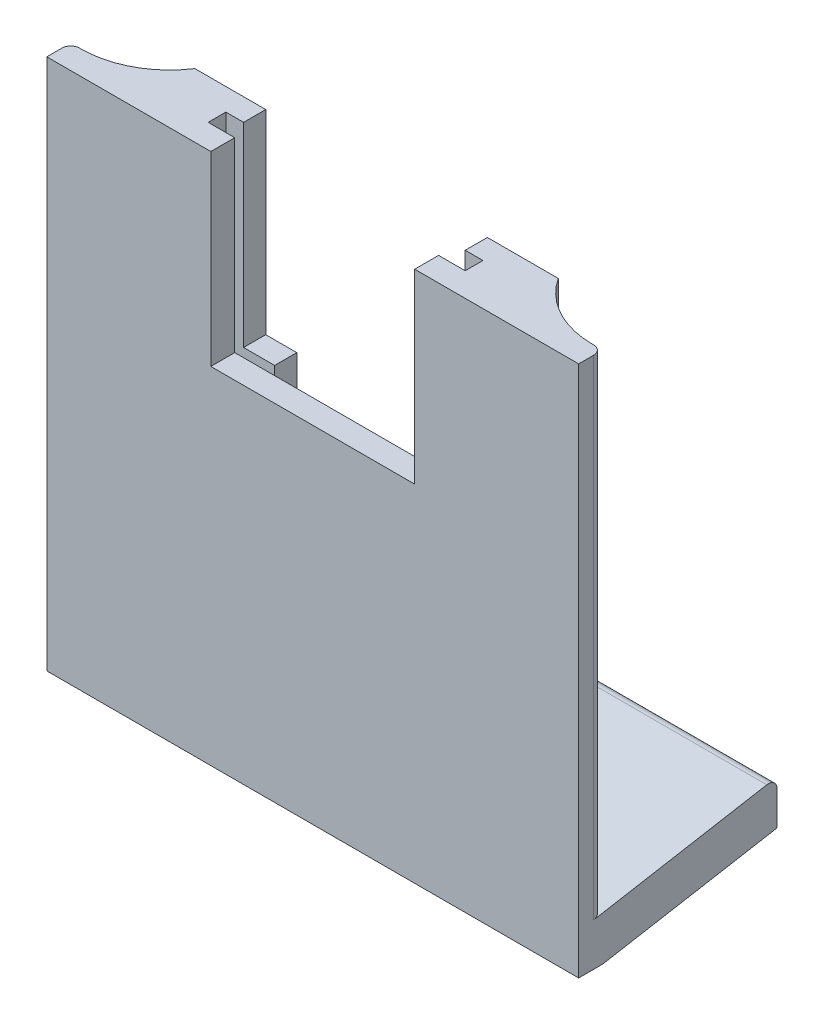
ISO-10303-21;
HEADER;
FILE_DESCRIPTION(('STEP AP214'),'2;1');
FILE_NAME('part.step','',(''),(''),'','','');
FILE_SCHEMA(('AUTOMOTIVE_DESIGN { 1 0 10303 214 1 1 1 1 }'));
ENDSEC;
DATA;
#1=APPLICATION_CONTEXT('core data for automotive mechanical design processes');
#2=APPLICATION_PROTOCOL_DEFINITION('international standard','automotive_design',2000,#1);
#3=PRODUCT_CONTEXT('',#1,'mechanical');
#4=PRODUCT('Part','Part','',(#3));
#5=PRODUCT_RELATED_PRODUCT_CATEGORY('part','',(#4));
#6=PRODUCT_DEFINITION_FORMATION('','',#4);
#7=PRODUCT_DEFINITION_CONTEXT('part definition',#1,'design');
#8=PRODUCT_DEFINITION('design','',#6,#7);
#9=PRODUCT_DEFINITION_SHAPE('','',#8);
#10=(LENGTH_UNIT() NAMED_UNIT(*) SI_UNIT(.MILLI.,.METRE.));
#11=(NAMED_UNIT(*) PLANE_ANGLE_UNIT() SI_UNIT($,.RADIAN.));
#12=(NAMED_UNIT(*) SI_UNIT($,.STERADIAN.) SOLID_ANGLE_UNIT());
#13=UNCERTAINTY_MEASURE_WITH_UNIT(LENGTH_MEASURE(1.E-05),#10,'distance_accuracy_value','');
#14=(GEOMETRIC_REPRESENTATION_CONTEXT(3) GLOBAL_UNCERTAINTY_ASSIGNED_CONTEXT((#13)) GLOBAL_UNIT_ASSIGNED_CONTEXT((#10,
#11,#12)) REPRESENTATION_CONTEXT('',''));
#15=CARTESIAN_POINT('',(0.,0.,0.));
#16=DIRECTION('',(0.,0.,1.));
#17=DIRECTION('',(1.,0.,0.));
#18=AXIS2_PLACEMENT_3D('',#15,#16,#17);
#19=CARTESIAN_POINT('',(-47.8734939759036,16.7228915662651,-2.));
#20=DIRECTION('',(0.,-1.,0.));
#21=DIRECTION('',(0.,0.,-1.));
#22=AXIS2_PLACEMENT_3D('',#19,#20,#21);
#23=PLANE('',#22);
#24=DIRECTION('',(1.,0.,0.));
#25=VECTOR('',#24,1.);
#26=CARTESIAN_POINT('',(-47.8734939759036,16.7228915662651,0.));
#27=LINE('',#26,#25);
#28=CARTESIAN_POINT('',(-47.8734939759036,16.7228915662651,0.));
#29=VERTEX_POINT('',#28);
#30=CARTESIAN_POINT('',(-42.3734939759036,16.7228915662651,0.));
#31=VERTEX_POINT('',#30);
#32=EDGE_CURVE('E367',#29,#31,#27,.T.);
#33=ORIENTED_EDGE('',*,*,#32,.T.);
#34=DIRECTION('',(0.,0.,-1.));
#35=VECTOR('',#34,1.);
#36=CARTESIAN_POINT('',(-42.3734939759036,16.7228915662651,-2.));
#37=LINE('',#36,#35);
#38=CARTESIAN_POINT('',(-42.3734939759036,16.7228915662651,-2.));
#39=VERTEX_POINT('',#38);
#40=EDGE_CURVE('E304',#31,#39,#37,.T.);
#41=ORIENTED_EDGE('',*,*,#40,.T.);
#42=DIRECTION('',(1.,0.,0.));
#43=VECTOR('',#42,1.);
#44=CARTESIAN_POINT('',(-47.8734939759036,16.7228915662651,-2.));
#45=LINE('',#44,#43);
#46=CARTESIAN_POINT('',(-47.8734939759036,16.7228915662651,-2.));
#47=VERTEX_POINT('',#46);
#48=EDGE_CURVE('E356',#47,#39,#45,.T.);
#49=ORIENTED_EDGE('',*,*,#48,.F.);
#50=DIRECTION('',(0.,0.,1.));
#51=VECTOR('',#50,1.);
#52=CARTESIAN_POINT('',(-47.8734939759036,16.7228915662651,-2.));
#53=LINE('',#52,#51);
#54=EDGE_CURVE('E366',#47,#29,#53,.T.);
#55=ORIENTED_EDGE('',*,*,#54,.T.);
#56=EDGE_LOOP('',(#33,#41,#49,#55));
#57=FACE_BOUND('',#56,.T.);
#58=ADVANCED_FACE('F39',(#57),#23,.F.);
#59=CARTESIAN_POINT('',(0.,0.,-2.));
#60=DIRECTION('',(0.,0.,-1.));
#61=DIRECTION('',(-1.,0.,0.));
#62=AXIS2_PLACEMENT_3D('',#59,#60,#61);
#63=PLANE('',#62);
#64=ORIENTED_EDGE('',*,*,#48,.T.);
#65=DIRECTION('',(0.,1.,0.));
#66=VECTOR('',#65,1.);
#67=CARTESIAN_POINT('',(-42.3734939759036,0.,-2.));
#68=LINE('',#67,#66);
#69=CARTESIAN_POINT('',(-42.3734939759036,18.7228915662651,-2.));
#70=VERTEX_POINT('',#69);
#71=EDGE_CURVE('E301',#39,#70,#68,.T.);
#72=ORIENTED_EDGE('',*,*,#71,.T.);
#73=DIRECTION('',(1.,0.,0.));
#74=VECTOR('',#73,1.);
#75=CARTESIAN_POINT('',(-45.8734939759036,18.7228915662651,-2.));
#76=LINE('',#75,#74);
#77=CARTESIAN_POINT('',(-45.8734939759036,18.7228915662651,-2.));
#78=VERTEX_POINT('',#77);
#79=EDGE_CURVE('E340',#78,#70,#76,.T.);
#80=ORIENTED_EDGE('',*,*,#79,.F.);
#81=DIRECTION('',(0.,-1.,0.));
#82=VECTOR('',#81,1.);
#83=CARTESIAN_POINT('',(-45.8734939759036,40.7228915662651,-2.));
#84=LINE('',#83,#82);
#85=CARTESIAN_POINT('',(-45.8734939759036,40.7228915662651,-2.));
#86=VERTEX_POINT('',#85);
#87=EDGE_CURVE('E337',#86,#78,#84,.T.);
#88=ORIENTED_EDGE('',*,*,#87,.F.);
#89=DIRECTION('',(1.,0.,0.));
#90=VECTOR('',#89,1.);
#91=CARTESIAN_POINT('',(-45.8734939759036,40.7228915662651,-2.));
#92=LINE('',#91,#90);
#93=CARTESIAN_POINT('',(-47.8734939759036,40.7228915662651,-2.));
#94=VERTEX_POINT('',#93);
#95=EDGE_CURVE('E335',#94,#86,#92,.T.);
#96=ORIENTED_EDGE('',*,*,#95,.F.);
#97=DIRECTION('',(0.,-1.,0.));
#98=VECTOR('',#97,1.);
#99=CARTESIAN_POINT('',(-47.8734939759036,16.7228915662651,-2.));
#100=LINE('',#99,#98);
#101=EDGE_CURVE('E363',#94,#47,#100,.T.);
#102=ORIENTED_EDGE('',*,*,#101,.T.);
#103=EDGE_LOOP('',(#64,#72,#80,#88,#96,#102));
#104=FACE_BOUND('',#103,.T.);
#105=ADVANCED_FACE('F517',(#104),#63,.F.);
#106=CARTESIAN_POINT('',(-45.8734939759036,18.7228915662651,-4.5));
#107=DIRECTION('',(0.,-1.,0.));
#108=DIRECTION('',(0.,0.,-1.));
#109=AXIS2_PLACEMENT_3D('',#106,#107,#108);
#110=PLANE('',#109);
#111=ORIENTED_EDGE('',*,*,#79,.T.);
#112=DIRECTION('',(0.,0.,-1.));
#113=VECTOR('',#112,1.);
#114=CARTESIAN_POINT('',(-42.3734939759036,18.7228915662651,26.926842746113));
#115=LINE('',#114,#113);
#116=CARTESIAN_POINT('',(-42.3734939759036,18.7228915662651,-4.5));
#117=VERTEX_POINT('',#116);
#118=EDGE_CURVE('E292',#70,#117,#115,.T.);
#119=ORIENTED_EDGE('',*,*,#118,.T.);
#120=DIRECTION('',(1.,0.,0.));
#121=VECTOR('',#120,1.);
#122=CARTESIAN_POINT('',(-45.8734939759036,18.7228915662651,-4.5));
#123=LINE('',#122,#121);
#124=CARTESIAN_POINT('',(-45.8734939759036,18.7228915662651,-4.5));
#125=VERTEX_POINT('',#124);
#126=EDGE_CURVE('E327',#125,#117,#123,.T.);
#127=ORIENTED_EDGE('',*,*,#126,.F.);
#128=DIRECTION('',(0.,0.,1.));
#129=VECTOR('',#128,1.);
#130=CARTESIAN_POINT('',(-45.8734939759036,18.7228915662651,-4.5));
#131=LINE('',#130,#129);
#132=EDGE_CURVE('E349',#125,#78,#131,.T.);
#133=ORIENTED_EDGE('',*,*,#132,.T.);
#134=EDGE_LOOP('',(#111,#119,#127,#133));
#135=FACE_BOUND('',#134,.T.);
#136=ADVANCED_FACE('F525',(#135),#110,.F.);
#137=CARTESIAN_POINT('',(0.,0.,-4.5));
#138=DIRECTION('',(0.,0.,-1.));
#139=DIRECTION('',(-1.,0.,0.));
#140=AXIS2_PLACEMENT_3D('',#137,#138,#139);
#141=PLANE('',#140);
#142=DIRECTION('',(0.,1.,0.));
#143=VECTOR('',#142,1.);
#144=CARTESIAN_POINT('',(-42.3734939759036,-1.30346257706057,-4.5));
#145=LINE('',#144,#143);
#146=CARTESIAN_POINT('',(-42.3734939759036,10.7228915662651,-4.5));
#147=VERTEX_POINT('',#146);
#148=EDGE_CURVE('E281',#147,#117,#145,.T.);
#149=ORIENTED_EDGE('',*,*,#148,.F.);
#150=DIRECTION('',(-1.,0.,0.));
#151=VECTOR('',#150,1.);
#152=CARTESIAN_POINT('',(-12.8734939759036,10.7228915662651,-4.5));
#153=LINE('',#152,#151);
#154=CARTESIAN_POINT('',(-53.8734939759036,10.7228915662651,-4.5));
#155=VERTEX_POINT('',#154);
#156=EDGE_CURVE('E315',#147,#155,#153,.T.);
#157=ORIENTED_EDGE('',*,*,#156,.T.);
#158=DIRECTION('',(0.,1.,0.));
#159=VECTOR('',#158,1.);
#160=CARTESIAN_POINT('',(-53.8734939759036,10.7228915662651,-4.5));
#161=LINE('',#160,#159);
#162=CARTESIAN_POINT('',(-53.8734939759036,40.7228915662651,-4.5));
#163=VERTEX_POINT('',#162);
#164=EDGE_CURVE('E319',#155,#163,#161,.T.);
#165=ORIENTED_EDGE('',*,*,#164,.T.);
#166=DIRECTION('',(1.,0.,0.));
#167=VECTOR('',#166,1.);
#168=CARTESIAN_POINT('',(-45.8734939759036,40.7228915662651,-4.5));
#169=LINE('',#168,#167);
#170=CARTESIAN_POINT('',(-45.8734939759036,40.7228915662651,-4.5));
#171=VERTEX_POINT('',#170);
#172=EDGE_CURVE('E322',#163,#171,#169,.T.);
#173=ORIENTED_EDGE('',*,*,#172,.T.);
#174=DIRECTION('',(0.,-1.,0.));
#175=VECTOR('',#174,1.);
#176=CARTESIAN_POINT('',(-45.8734939759036,40.7228915662651,-4.5));
#177=LINE('',#176,#175);
#178=EDGE_CURVE('E324',#171,#125,#177,.T.);
#179=ORIENTED_EDGE('',*,*,#178,.T.);
#180=ORIENTED_EDGE('',*,*,#126,.T.);
#181=EDGE_LOOP('',(#149,#157,#165,#173,#179,#180));
#182=FACE_BOUND('',#181,.T.);
#183=ADVANCED_FACE('F598',(#182),#141,.T.);
#184=CARTESIAN_POINT('',(-53.8734939759036,2.37124502202004,-10.));
#185=DIRECTION('',(-1.,0.,0.));
#186=DIRECTION('',(0.,-1.,0.));
#187=AXIS2_PLACEMENT_3D('',#184,#185,#186);
#188=CYLINDRICAL_SURFACE('',#187,10.);
#189=ORIENTED_EDGE('',*,*,#156,.F.);
#190=CARTESIAN_POINT('',(-42.3734939759036,2.37124502202003,-10.));
#191=DIRECTION('',(-1.,0.,0.));
#192=DIRECTION('',(0.,0.,1.));
#193=AXIS2_PLACEMENT_3D('',#190,#191,#192);
#194=CIRCLE('',#193,10.);
#195=CARTESIAN_POINT('',(-42.3734939759036,2.37124502202003,0.));
#196=VERTEX_POINT('',#195);
#197=EDGE_CURVE('E462',#147,#196,#194,.F.);
#198=ORIENTED_EDGE('',*,*,#197,.T.);
#199=DIRECTION('',(-1.,0.,0.));
#200=VECTOR('',#199,1.);
#201=CARTESIAN_POINT('',(0.,2.37124502202003,0.));
#202=LINE('',#201,#200);
#203=CARTESIAN_POINT('',(-62.2251405201487,2.37124502202004,0.));
#204=VERTEX_POINT('',#203);
#205=EDGE_CURVE('E451',#204,#196,#202,.F.);
#206=ORIENTED_EDGE('',*,*,#205,.F.);
#207=CARTESIAN_POINT('',(-62.2251405201487,2.37124502202004,-10.));
#208=DIRECTION('',(-0.707106781186547,0.707106781186548,0.));
#209=DIRECTION('',(0.707106781186548,0.707106781186547,0.));
#210=AXIS2_PLACEMENT_3D('',#207,#208,#209);
#211=ELLIPSE('',#210,14.1421356237309,10.);
#212=EDGE_CURVE('E454',#155,#204,#211,.F.);
#213=ORIENTED_EDGE('',*,*,#212,.F.);
#214=EDGE_LOOP('',(#189,#198,#206,#213));
#215=FACE_BOUND('',#214,.T.);
#216=ADVANCED_FACE('F640',(#215),#188,.F.);
#217=CARTESIAN_POINT('',(0.,0.,0.));
#218=DIRECTION('',(0.,0.,1.));
#219=DIRECTION('',(1.,0.,0.));
#220=AXIS2_PLACEMENT_3D('',#217,#218,#219);
#221=PLANE('',#220);
#222=DIRECTION('',(1.,0.,0.));
#223=VECTOR('',#222,1.);
#224=CARTESIAN_POINT('',(0.,40.7228915662651,0.));
#225=LINE('',#224,#223);
#226=CARTESIAN_POINT('',(-4.52184743165859,40.7228915662651,0.));
#227=VERTEX_POINT('',#226);
#228=CARTESIAN_POINT('',(-4.37349397590363,40.7228915662651,0.));
#229=VERTEX_POINT('',#228);
#230=EDGE_CURVE('E417',#227,#229,#225,.T.);
#231=ORIENTED_EDGE('',*,*,#230,.T.);
#232=DIRECTION('',(0.,-1.,0.));
#233=VECTOR('',#232,1.);
#234=CARTESIAN_POINT('',(-4.37349397590362,-14.2771084337349,0.));
#235=LINE('',#234,#233);
#236=CARTESIAN_POINT('',(-4.37349397590362,-14.2771084337349,0.));
#237=VERTEX_POINT('',#236);
#238=EDGE_CURVE('E474',#229,#237,#235,.T.);
#239=ORIENTED_EDGE('',*,*,#238,.T.);
#240=DIRECTION('',(1.,0.,0.));
#241=VECTOR('',#240,1.);
#242=CARTESIAN_POINT('',(-3.37349397590362,-14.2771084337349,0.));
#243=LINE('',#242,#241);
#244=CARTESIAN_POINT('',(-62.3734939759036,-14.2771084337349,0.));
#245=VERTEX_POINT('',#244);
#246=EDGE_CURVE('E271',#245,#237,#243,.T.);
#247=ORIENTED_EDGE('',*,*,#246,.F.);
#248=DIRECTION('',(0.,-1.,0.));
#249=VECTOR('',#248,1.);
#250=CARTESIAN_POINT('',(-62.3734939759036,0.,0.));
#251=LINE('',#250,#249);
#252=CARTESIAN_POINT('',(-62.3734939759036,40.7228915662651,0.));
#253=VERTEX_POINT('',#252);
#254=EDGE_CURVE('E468',#245,#253,#251,.F.);
#255=ORIENTED_EDGE('',*,*,#254,.T.);
#256=CARTESIAN_POINT('',(-62.2251405201487,40.7228915662651,0.));
#257=VERTEX_POINT('',#256);
#258=EDGE_CURVE('E415',#253,#257,#225,.T.);
#259=ORIENTED_EDGE('',*,*,#258,.T.);
#260=DIRECTION('',(0.,1.,0.));
#261=VECTOR('',#260,1.);
#262=CARTESIAN_POINT('',(-62.2251405201487,0.,0.));
#263=LINE('',#262,#261);
#264=EDGE_CURVE('E445',#257,#204,#263,.F.);
#265=ORIENTED_EDGE('',*,*,#264,.T.);
#266=ORIENTED_EDGE('',*,*,#205,.T.);
#267=DIRECTION('',(0.,1.,0.));
#268=VECTOR('',#267,1.);
#269=CARTESIAN_POINT('',(-42.3734939759036,-1.30346257706057,0.));
#270=LINE('',#269,#268);
#271=EDGE_CURVE('E283',#196,#31,#270,.T.);
#272=ORIENTED_EDGE('',*,*,#271,.T.);
#273=ORIENTED_EDGE('',*,*,#32,.F.);
#274=DIRECTION('',(0.,-1.,0.));
#275=VECTOR('',#274,1.);
#276=CARTESIAN_POINT('',(-47.8734939759036,16.7228915662651,0.));
#277=LINE('',#276,#275);
#278=CARTESIAN_POINT('',(-47.8734939759036,40.7228915662651,0.));
#279=VERTEX_POINT('',#278);
#280=EDGE_CURVE('E373',#279,#29,#277,.T.);
#281=ORIENTED_EDGE('',*,*,#280,.F.);
#282=CARTESIAN_POINT('',(-44.8734939759036,40.7228915662651,0.));
#283=VERTEX_POINT('',#282);
#284=EDGE_CURVE('E414',#279,#283,#225,.T.);
#285=ORIENTED_EDGE('',*,*,#284,.T.);
#286=DIRECTION('',(0.,1.,0.));
#287=VECTOR('',#286,1.);
#288=CARTESIAN_POINT('',(-44.8734939759036,0.,0.));
#289=LINE('',#288,#287);
#290=CARTESIAN_POINT('',(-44.8734939759036,19.7228915662651,0.));
#291=VERTEX_POINT('',#290);
#292=EDGE_CURVE('E411',#291,#283,#289,.T.);
#293=ORIENTED_EDGE('',*,*,#292,.F.);
#294=DIRECTION('',(1.,0.,0.));
#295=VECTOR('',#294,1.);
#296=CARTESIAN_POINT('',(0.,19.7228915662651,0.));
#297=LINE('',#296,#295);
#298=CARTESIAN_POINT('',(-21.8734939759036,19.7228915662651,0.));
#299=VERTEX_POINT('',#298);
#300=EDGE_CURVE('E387',#291,#299,#297,.T.);
#301=ORIENTED_EDGE('',*,*,#300,.T.);
#302=DIRECTION('',(0.,1.,0.));
#303=VECTOR('',#302,1.);
#304=CARTESIAN_POINT('',(-21.8734939759036,0.,0.));
#305=LINE('',#304,#303);
#306=CARTESIAN_POINT('',(-21.8734939759036,40.7228915662651,0.));
#307=VERTEX_POINT('',#306);
#308=EDGE_CURVE('E392',#299,#307,#305,.T.);
#309=ORIENTED_EDGE('',*,*,#308,.T.);
#310=CARTESIAN_POINT('',(-18.8734939759036,40.7228915662651,0.));
#311=VERTEX_POINT('',#310);
#312=EDGE_CURVE('E418',#307,#311,#225,.T.);
#313=ORIENTED_EDGE('',*,*,#312,.T.);
#314=DIRECTION('',(0.,1.,0.));
#315=VECTOR('',#314,1.);
#316=CARTESIAN_POINT('',(-18.8734939759036,16.7228915662651,0.));
#317=LINE('',#316,#315);
#318=CARTESIAN_POINT('',(-18.8734939759036,16.7228915662651,0.));
#319=VERTEX_POINT('',#318);
#320=EDGE_CURVE('E370',#319,#311,#317,.T.);
#321=ORIENTED_EDGE('',*,*,#320,.F.);
#322=CARTESIAN_POINT('',(-24.3734939759036,16.7228915662651,0.));
#323=VERTEX_POINT('',#322);
#324=EDGE_CURVE('E355',#323,#319,#27,.T.);
#325=ORIENTED_EDGE('',*,*,#324,.F.);
#326=DIRECTION('',(0.,-1.,0.));
#327=VECTOR('',#326,1.);
#328=CARTESIAN_POINT('',(-24.3734939759036,-1.30346257706057,0.));
#329=LINE('',#328,#327);
#330=CARTESIAN_POINT('',(-24.3734939759036,2.37124502202003,0.));
#331=VERTEX_POINT('',#330);
#332=EDGE_CURVE('E285',#323,#331,#329,.T.);
#333=ORIENTED_EDGE('',*,*,#332,.T.);
#334=CARTESIAN_POINT('',(-4.52184743165859,2.37124502202003,0.));
#335=VERTEX_POINT('',#334);
#336=EDGE_CURVE('E450',#331,#335,#202,.F.);
#337=ORIENTED_EDGE('',*,*,#336,.T.);
#338=DIRECTION('',(0.,-1.,0.));
#339=VECTOR('',#338,1.);
#340=CARTESIAN_POINT('',(-4.52184743165859,0.,0.));
#341=LINE('',#340,#339);
#342=EDGE_CURVE('E441',#335,#227,#341,.F.);
#343=ORIENTED_EDGE('',*,*,#342,.T.);
#344=EDGE_LOOP('',(#231,#239,#247,#255,#259,#265,#266,#272,#273,#281,#285,#293,#301,#309,#313,
#321,#325,#333,#337,#343));
#345=FACE_BOUND('',#344,.T.);
#346=ADVANCED_FACE('F578',(#345),#221,.F.);
#347=CARTESIAN_POINT('',(0.,19.7228915662651,2.7));
#348=DIRECTION('',(0.,1.,0.));
#349=DIRECTION('',(-1.,0.,0.));
#350=AXIS2_PLACEMENT_3D('',#347,#348,#349);
#351=PLANE('',#350);
#352=ORIENTED_EDGE('',*,*,#300,.F.);
#353=DIRECTION('',(0.,0.,-1.));
#354=VECTOR('',#353,1.);
#355=CARTESIAN_POINT('',(-44.8734939759036,19.7228915662651,2.7));
#356=LINE('',#355,#354);
#357=CARTESIAN_POINT('',(-44.8734939759036,19.7228915662651,2.7));
#358=VERTEX_POINT('',#357);
#359=EDGE_CURVE('E439',#358,#291,#356,.T.);
#360=ORIENTED_EDGE('',*,*,#359,.F.);
#361=DIRECTION('',(1.,0.,0.));
#362=VECTOR('',#361,1.);
#363=CARTESIAN_POINT('',(0.,19.7228915662651,2.7));
#364=LINE('',#363,#362);
#365=CARTESIAN_POINT('',(-21.8734939759036,19.7228915662651,2.7));
#366=VERTEX_POINT('',#365);
#367=EDGE_CURVE('E388',#358,#366,#364,.T.);
#368=ORIENTED_EDGE('',*,*,#367,.T.);
#369=DIRECTION('',(0.,0.,-1.));
#370=VECTOR('',#369,1.);
#371=CARTESIAN_POINT('',(-21.8734939759036,19.7228915662651,2.7));
#372=LINE('',#371,#370);
#373=EDGE_CURVE('E408',#366,#299,#372,.T.);
#374=ORIENTED_EDGE('',*,*,#373,.T.);
#375=EDGE_LOOP('',(#352,#360,#368,#374));
#376=FACE_BOUND('',#375,.T.);
#377=ADVANCED_FACE('F616',(#376),#351,.T.);
#378=CARTESIAN_POINT('',(-44.8734939759036,0.,2.7));
#379=DIRECTION('',(-1.,0.,0.));
#380=DIRECTION('',(0.,0.,1.));
#381=AXIS2_PLACEMENT_3D('',#378,#379,#380);
#382=PLANE('',#381);
#383=ORIENTED_EDGE('',*,*,#292,.T.);
#384=DIRECTION('',(0.,0.,-1.));
#385=VECTOR('',#384,1.);
#386=CARTESIAN_POINT('',(-44.8734939759036,40.7228915662651,2.7));
#387=LINE('',#386,#385);
#388=CARTESIAN_POINT('',(-44.8734939759036,40.7228915662651,2.7));
#389=VERTEX_POINT('',#388);
#390=EDGE_CURVE('E436',#389,#283,#387,.T.);
#391=ORIENTED_EDGE('',*,*,#390,.F.);
#392=DIRECTION('',(0.,1.,0.));
#393=VECTOR('',#392,1.);
#394=CARTESIAN_POINT('',(-44.8734939759036,0.,2.7));
#395=LINE('',#394,#393);
#396=EDGE_CURVE('E391',#358,#389,#395,.T.);
#397=ORIENTED_EDGE('',*,*,#396,.F.);
#398=ORIENTED_EDGE('',*,*,#359,.T.);
#399=EDGE_LOOP('',(#383,#391,#397,#398));
#400=FACE_BOUND('',#399,.T.);
#401=ADVANCED_FACE('F618',(#400),#382,.F.);
#402=CARTESIAN_POINT('',(0.,40.7228915662651,2.7));
#403=DIRECTION('',(0.,1.,0.));
#404=DIRECTION('',(0.,0.,1.));
#405=AXIS2_PLACEMENT_3D('',#402,#403,#404);
#406=PLANE('',#405);
#407=ORIENTED_EDGE('',*,*,#258,.F.);
#408=CARTESIAN_POINT('',(-62.3734939759036,40.7228915662651,1.));
#409=DIRECTION('',(0.,1.,0.));
#410=DIRECTION('',(0.,0.,1.));
#411=AXIS2_PLACEMENT_3D('',#408,#409,#410);
#412=CIRCLE('',#411,1.);
#413=CARTESIAN_POINT('',(-63.3734939759036,40.7228915662651,1.));
#414=VERTEX_POINT('',#413);
#415=EDGE_CURVE('E470',#253,#414,#412,.T.);
#416=ORIENTED_EDGE('',*,*,#415,.T.);
#417=DIRECTION('',(0.,0.,-1.));
#418=VECTOR('',#417,1.);
#419=CARTESIAN_POINT('',(-63.3734939759036,40.7228915662651,2.7));
#420=LINE('',#419,#418);
#421=CARTESIAN_POINT('',(-63.3734939759036,40.7228915662651,2.7));
#422=VERTEX_POINT('',#421);
#423=EDGE_CURVE('E433',#422,#414,#420,.T.);
#424=ORIENTED_EDGE('',*,*,#423,.F.);
#425=DIRECTION('',(1.,0.,0.));
#426=VECTOR('',#425,1.);
#427=CARTESIAN_POINT('',(0.,40.7228915662651,2.7));
#428=LINE('',#427,#426);
#429=EDGE_CURVE('E394',#422,#389,#428,.T.);
#430=ORIENTED_EDGE('',*,*,#429,.T.);
#431=ORIENTED_EDGE('',*,*,#390,.T.);
#432=ORIENTED_EDGE('',*,*,#284,.F.);
#433=DIRECTION('',(0.,0.,1.));
#434=VECTOR('',#433,1.);
#435=CARTESIAN_POINT('',(-47.8734939759036,40.7228915662651,-2.));
#436=LINE('',#435,#434);
#437=EDGE_CURVE('E378',#94,#279,#436,.T.);
#438=ORIENTED_EDGE('',*,*,#437,.F.);
#439=ORIENTED_EDGE('',*,*,#95,.T.);
#440=DIRECTION('',(0.,0.,1.));
#441=VECTOR('',#440,1.);
#442=CARTESIAN_POINT('',(-45.8734939759036,40.7228915662651,-4.5));
#443=LINE('',#442,#441);
#444=EDGE_CURVE('E352',#171,#86,#443,.T.);
#445=ORIENTED_EDGE('',*,*,#444,.F.);
#446=ORIENTED_EDGE('',*,*,#172,.F.);
#447=CARTESIAN_POINT('',(-62.2251405201487,40.7228915662651,-10.));
#448=DIRECTION('',(0.,1.,0.));
#449=DIRECTION('',(0.,0.,1.));
#450=AXIS2_PLACEMENT_3D('',#447,#448,#449);
#451=CIRCLE('',#450,10.);
#452=EDGE_CURVE('E447',#163,#257,#451,.F.);
#453=ORIENTED_EDGE('',*,*,#452,.T.);
#454=EDGE_LOOP('',(#407,#416,#424,#430,#431,#432,#438,#439,#445,#446,#453));
#455=FACE_BOUND('',#454,.T.);
#456=ADVANCED_FACE('F503',(#455),#406,.T.);
#457=CARTESIAN_POINT('',(-63.3734939759036,0.,2.7));
#458=DIRECTION('',(1.,0.,0.));
#459=DIRECTION('',(0.,1.,0.));
#460=AXIS2_PLACEMENT_3D('',#457,#458,#459);
#461=PLANE('',#460);
#462=DIRECTION('',(0.,0.173648177666934,-0.984807753012207));
#463=VECTOR('',#462,1.);
#464=CARTESIAN_POINT('',(-63.3734939759036,-14.2771084337349,0.));
#465=LINE('',#464,#463);
#466=CARTESIAN_POINT('',(-63.3734939759036,-14.4534354144434,1.));
#467=VERTEX_POINT('',#466);
#468=CARTESIAN_POINT('',(-63.3734939759036,-11.0110907199782,-18.5225068825772));
#469=VERTEX_POINT('',#468);
#470=EDGE_CURVE('E266',#467,#469,#465,.T.);
#471=ORIENTED_EDGE('',*,*,#470,.T.);
#472=CARTESIAN_POINT('',(-63.3734939759036,-11.9958984729905,-18.6961550602441));
#473=DIRECTION('',(1.,0.,0.));
#474=DIRECTION('',(0.,1.,0.));
#475=AXIS2_PLACEMENT_3D('',#472,#473,#474);
#476=CIRCLE('',#475,0.999999999999999);
#477=CARTESIAN_POINT('',(-63.3734939759036,-11.9958984729905,-19.6961550602441));
#478=VERTEX_POINT('',#477);
#479=EDGE_CURVE('E11',#469,#478,#476,.F.);
#480=ORIENTED_EDGE('',*,*,#479,.T.);
#481=DIRECTION('',(0.,1.,0.));
#482=VECTOR('',#481,1.);
#483=CARTESIAN_POINT('',(-63.3734939759036,-15.8041448803962,-19.6961550602441));
#484=LINE('',#483,#482);
#485=CARTESIAN_POINT('',(-63.3734939759036,-15.8041448803962,-19.6961550602441));
#486=VERTEX_POINT('',#485);
#487=EDGE_CURVE('E250',#486,#478,#484,.T.);
#488=ORIENTED_EDGE('',*,*,#487,.F.);
#489=DIRECTION('',(0.,0.173648177666934,-0.984807753012207));
#490=VECTOR('',#489,1.);
#491=CARTESIAN_POINT('',(-63.3734939759036,-19.2771084337349,0.));
#492=LINE('',#491,#490);
#493=CARTESIAN_POINT('',(-63.3734939759036,-19.2771084337349,0.));
#494=VERTEX_POINT('',#493);
#495=EDGE_CURVE('E264',#494,#486,#492,.T.);
#496=ORIENTED_EDGE('',*,*,#495,.F.);
#497=DIRECTION('',(0.,0.,-1.));
#498=VECTOR('',#497,1.);
#499=CARTESIAN_POINT('',(-63.3734939759036,-19.2771084337349,2.7));
#500=LINE('',#499,#498);
#501=CARTESIAN_POINT('',(-63.3734939759036,-19.2771084337349,2.7));
#502=VERTEX_POINT('',#501);
#503=EDGE_CURVE('E431',#502,#494,#500,.T.);
#504=ORIENTED_EDGE('',*,*,#503,.F.);
#505=DIRECTION('',(0.,-1.,0.));
#506=VECTOR('',#505,1.);
#507=CARTESIAN_POINT('',(-63.3734939759036,0.,2.7));
#508=LINE('',#507,#506);
#509=EDGE_CURVE('E397',#422,#502,#508,.T.);
#510=ORIENTED_EDGE('',*,*,#509,.F.);
#511=ORIENTED_EDGE('',*,*,#423,.T.);
#512=DIRECTION('',(0.,-1.,0.));
#513=VECTOR('',#512,1.);
#514=CARTESIAN_POINT('',(-63.3734939759036,0.,1.));
#515=LINE('',#514,#513);
#516=EDGE_CURVE('E465',#414,#467,#515,.T.);
#517=ORIENTED_EDGE('',*,*,#516,.T.);
#518=EDGE_LOOP('',(#471,#480,#488,#496,#504,#510,#511,#517));
#519=FACE_BOUND('',#518,.T.);
#520=ADVANCED_FACE('F262',(#519),#461,.F.);
#521=CARTESIAN_POINT('',(0.,-19.2771084337349,2.7));
#522=DIRECTION('',(0.,1.,0.));
#523=DIRECTION('',(0.,0.,1.));
#524=AXIS2_PLACEMENT_3D('',#521,#522,#523);
#525=PLANE('',#524);
#526=DIRECTION('',(1.,0.,0.));
#527=VECTOR('',#526,1.);
#528=CARTESIAN_POINT('',(0.,-19.2771084337349,0.));
#529=LINE('',#528,#527);
#530=CARTESIAN_POINT('',(-3.37349397590362,-19.2771084337349,0.));
#531=VERTEX_POINT('',#530);
#532=EDGE_CURVE('E270',#494,#531,#529,.T.);
#533=ORIENTED_EDGE('',*,*,#532,.T.);
#534=DIRECTION('',(0.,0.,-1.));
#535=VECTOR('',#534,1.);
#536=CARTESIAN_POINT('',(-3.37349397590362,-19.2771084337349,2.7));
#537=LINE('',#536,#535);
#538=CARTESIAN_POINT('',(-3.37349397590362,-19.2771084337349,2.7));
#539=VERTEX_POINT('',#538);
#540=EDGE_CURVE('E428',#539,#531,#537,.T.);
#541=ORIENTED_EDGE('',*,*,#540,.F.);
#542=DIRECTION('',(1.,0.,0.));
#543=VECTOR('',#542,1.);
#544=CARTESIAN_POINT('',(0.,-19.2771084337349,2.7));
#545=LINE('',#544,#543);
#546=EDGE_CURVE('E400',#502,#539,#545,.T.);
#547=ORIENTED_EDGE('',*,*,#546,.F.);
#548=ORIENTED_EDGE('',*,*,#503,.T.);
#549=EDGE_LOOP('',(#533,#541,#547,#548));
#550=FACE_BOUND('',#549,.T.);
#551=ADVANCED_FACE('F492',(#550),#525,.F.);
#552=CARTESIAN_POINT('',(-3.37349397590362,0.,2.7));
#553=DIRECTION('',(1.,0.,0.));
#554=DIRECTION('',(0.,1.,0.));
#555=AXIS2_PLACEMENT_3D('',#552,#553,#554);
#556=PLANE('',#555);
#557=DIRECTION('',(0.,-1.,0.));
#558=VECTOR('',#557,1.);
#559=CARTESIAN_POINT('',(-3.37349397590363,-15.8041448803962,-19.6961550602441));
#560=LINE('',#559,#558);
#561=CARTESIAN_POINT('',(-3.37349397590363,-11.9958984729905,-19.6961550602441));
#562=VERTEX_POINT('',#561);
#563=CARTESIAN_POINT('',(-3.37349397590363,-15.8041448803962,-19.6961550602441));
#564=VERTEX_POINT('',#563);
#565=EDGE_CURVE('E252',#562,#564,#560,.T.);
#566=ORIENTED_EDGE('',*,*,#565,.F.);
#567=CARTESIAN_POINT('',(-3.37349397590362,-11.9958984729905,-18.6961550602441));
#568=DIRECTION('',(1.,0.,0.));
#569=DIRECTION('',(0.,1.,0.));
#570=AXIS2_PLACEMENT_3D('',#567,#568,#569);
#571=CIRCLE('',#570,0.999999999999999);
#572=CARTESIAN_POINT('',(-3.37349397590363,-11.0110907199782,-18.5225068825772));
#573=VERTEX_POINT('',#572);
#574=EDGE_CURVE('E61',#562,#573,#571,.T.);
#575=ORIENTED_EDGE('',*,*,#574,.T.);
#576=DIRECTION('',(0.,0.173648177666934,-0.984807753012207));
#577=VECTOR('',#576,1.);
#578=CARTESIAN_POINT('',(-3.37349397590362,-14.2771084337349,0.));
#579=LINE('',#578,#577);
#580=CARTESIAN_POINT('',(-3.37349397590362,-14.4534354144434,1.));
#581=VERTEX_POINT('',#580);
#582=EDGE_CURVE('E277',#581,#573,#579,.T.);
#583=ORIENTED_EDGE('',*,*,#582,.F.);
#584=DIRECTION('',(0.,-1.,0.));
#585=VECTOR('',#584,1.);
#586=CARTESIAN_POINT('',(-3.37349397590363,40.7228915662651,1.));
#587=LINE('',#586,#585);
#588=CARTESIAN_POINT('',(-3.37349397590363,40.7228915662651,1.));
#589=VERTEX_POINT('',#588);
#590=EDGE_CURVE('E477',#581,#589,#587,.F.);
#591=ORIENTED_EDGE('',*,*,#590,.T.);
#592=DIRECTION('',(0.,0.,-1.));
#593=VECTOR('',#592,1.);
#594=CARTESIAN_POINT('',(-3.37349397590363,40.7228915662651,2.7));
#595=LINE('',#594,#593);
#596=CARTESIAN_POINT('',(-3.37349397590363,40.7228915662651,2.7));
#597=VERTEX_POINT('',#596);
#598=EDGE_CURVE('E425',#597,#589,#595,.T.);
#599=ORIENTED_EDGE('',*,*,#598,.F.);
#600=DIRECTION('',(0.,-1.,0.));
#601=VECTOR('',#600,1.);
#602=CARTESIAN_POINT('',(-3.37349397590362,0.,2.7));
#603=LINE('',#602,#601);
#604=EDGE_CURVE('E402',#597,#539,#603,.T.);
#605=ORIENTED_EDGE('',*,*,#604,.T.);
#606=ORIENTED_EDGE('',*,*,#540,.T.);
#607=DIRECTION('',(0.,0.173648177666934,-0.984807753012207));
#608=VECTOR('',#607,1.);
#609=CARTESIAN_POINT('',(-3.37349397590362,-19.2771084337349,0.));
#610=LINE('',#609,#608);
#611=EDGE_CURVE('E258',#531,#564,#610,.T.);
#612=ORIENTED_EDGE('',*,*,#611,.T.);
#613=EDGE_LOOP('',(#566,#575,#583,#591,#599,#605,#606,#612));
#614=FACE_BOUND('',#613,.T.);
#615=ADVANCED_FACE('F487',(#614),#556,.T.);
#616=ORIENTED_EDGE('',*,*,#598,.T.);
#617=CARTESIAN_POINT('',(-4.37349397590363,40.7228915662651,1.));
#618=DIRECTION('',(0.,1.,0.));
#619=DIRECTION('',(0.,0.,1.));
#620=AXIS2_PLACEMENT_3D('',#617,#618,#619);
#621=CIRCLE('',#620,1.);
#622=EDGE_CURVE('E479',#589,#229,#621,.T.);
#623=ORIENTED_EDGE('',*,*,#622,.T.);
#624=ORIENTED_EDGE('',*,*,#230,.F.);
#625=CARTESIAN_POINT('',(-4.52184743165859,40.7228915662651,-10.));
#626=DIRECTION('',(0.,1.,0.));
#627=DIRECTION('',(0.,0.,1.));
#628=AXIS2_PLACEMENT_3D('',#625,#626,#627);
#629=CIRCLE('',#628,10.);
#630=CARTESIAN_POINT('',(-12.8734939759036,40.7228915662651,-4.5));
#631=VERTEX_POINT('',#630);
#632=EDGE_CURVE('E443',#227,#631,#629,.F.);
#633=ORIENTED_EDGE('',*,*,#632,.T.);
#634=DIRECTION('',(1.,0.,0.));
#635=VECTOR('',#634,1.);
#636=CARTESIAN_POINT('',(-20.8734939759036,40.7228915662651,-4.5));
#637=LINE('',#636,#635);
#638=CARTESIAN_POINT('',(-20.8734939759036,40.7228915662651,-4.5));
#639=VERTEX_POINT('',#638);
#640=EDGE_CURVE('E308',#639,#631,#637,.T.);
#641=ORIENTED_EDGE('',*,*,#640,.F.);
#642=DIRECTION('',(0.,0.,1.));
#643=VECTOR('',#642,1.);
#644=CARTESIAN_POINT('',(-20.8734939759036,40.7228915662651,-4.5));
#645=LINE('',#644,#643);
#646=CARTESIAN_POINT('',(-20.8734939759036,40.7228915662651,-2.));
#647=VERTEX_POINT('',#646);
#648=EDGE_CURVE('E332',#639,#647,#645,.T.);
#649=ORIENTED_EDGE('',*,*,#648,.T.);
#650=DIRECTION('',(1.,0.,0.));
#651=VECTOR('',#650,1.);
#652=CARTESIAN_POINT('',(-20.8734939759036,40.7228915662651,-2.));
#653=LINE('',#652,#651);
#654=CARTESIAN_POINT('',(-18.8734939759036,40.7228915662651,-2.));
#655=VERTEX_POINT('',#654);
#656=EDGE_CURVE('E307',#647,#655,#653,.T.);
#657=ORIENTED_EDGE('',*,*,#656,.T.);
#658=DIRECTION('',(0.,0.,1.));
#659=VECTOR('',#658,1.);
#660=CARTESIAN_POINT('',(-18.8734939759036,40.7228915662651,-2.));
#661=LINE('',#660,#659);
#662=EDGE_CURVE('E381',#655,#311,#661,.T.);
#663=ORIENTED_EDGE('',*,*,#662,.T.);
#664=ORIENTED_EDGE('',*,*,#312,.F.);
#665=DIRECTION('',(0.,0.,-1.));
#666=VECTOR('',#665,1.);
#667=CARTESIAN_POINT('',(-21.8734939759036,40.7228915662651,2.7));
#668=LINE('',#667,#666);
#669=CARTESIAN_POINT('',(-21.8734939759036,40.7228915662651,2.7));
#670=VERTEX_POINT('',#669);
#671=EDGE_CURVE('E423',#670,#307,#668,.T.);
#672=ORIENTED_EDGE('',*,*,#671,.F.);
#673=EDGE_CURVE('E398',#670,#597,#428,.T.);
#674=ORIENTED_EDGE('',*,*,#673,.T.);
#675=EDGE_LOOP('',(#616,#623,#624,#633,#641,#649,#657,#663,#664,#672,#674));
#676=FACE_BOUND('',#675,.T.);
#677=ADVANCED_FACE('F553',(#676),#406,.T.);
#678=CARTESIAN_POINT('',(-21.8734939759036,0.,2.7));
#679=DIRECTION('',(-1.,0.,0.));
#680=DIRECTION('',(0.,0.,1.));
#681=AXIS2_PLACEMENT_3D('',#678,#679,#680);
#682=PLANE('',#681);
#683=ORIENTED_EDGE('',*,*,#308,.F.);
#684=ORIENTED_EDGE('',*,*,#373,.F.);
#685=DIRECTION('',(0.,1.,0.));
#686=VECTOR('',#685,1.);
#687=CARTESIAN_POINT('',(-21.8734939759036,0.,2.7));
#688=LINE('',#687,#686);
#689=EDGE_CURVE('E405',#366,#670,#688,.T.);
#690=ORIENTED_EDGE('',*,*,#689,.T.);
#691=ORIENTED_EDGE('',*,*,#671,.T.);
#692=EDGE_LOOP('',(#683,#684,#690,#691));
#693=FACE_BOUND('',#692,.T.);
#694=ADVANCED_FACE('F542',(#693),#682,.T.);
#695=CARTESIAN_POINT('',(0.,0.,2.7));
#696=DIRECTION('',(0.,0.,1.));
#697=DIRECTION('',(1.,0.,0.));
#698=AXIS2_PLACEMENT_3D('',#695,#696,#697);
#699=PLANE('',#698);
#700=ORIENTED_EDGE('',*,*,#367,.F.);
#701=ORIENTED_EDGE('',*,*,#396,.T.);
#702=ORIENTED_EDGE('',*,*,#429,.F.);
#703=ORIENTED_EDGE('',*,*,#509,.T.);
#704=ORIENTED_EDGE('',*,*,#546,.T.);
#705=ORIENTED_EDGE('',*,*,#604,.F.);
#706=ORIENTED_EDGE('',*,*,#673,.F.);
#707=ORIENTED_EDGE('',*,*,#689,.F.);
#708=EDGE_LOOP('',(#700,#701,#702,#703,#704,#705,#706,#707));
#709=FACE_BOUND('',#708,.T.);
#710=ADVANCED_FACE('F498',(#709),#699,.T.);
#711=CARTESIAN_POINT('',(-24.3734939759036,16.7228915662651,-2.));
#712=VERTEX_POINT('',#711);
#713=CARTESIAN_POINT('',(-18.8734939759036,16.7228915662651,-2.));
#714=VERTEX_POINT('',#713);
#715=EDGE_CURVE('E360',#712,#714,#45,.T.);
#716=ORIENTED_EDGE('',*,*,#715,.F.);
#717=DIRECTION('',(0.,0.,1.));
#718=VECTOR('',#717,1.);
#719=CARTESIAN_POINT('',(-24.3734939759036,16.7228915662651,-2.));
#720=LINE('',#719,#718);
#721=EDGE_CURVE('E298',#712,#323,#720,.T.);
#722=ORIENTED_EDGE('',*,*,#721,.T.);
#723=ORIENTED_EDGE('',*,*,#324,.T.);
#724=DIRECTION('',(0.,0.,1.));
#725=VECTOR('',#724,1.);
#726=CARTESIAN_POINT('',(-18.8734939759036,16.7228915662651,-2.));
#727=LINE('',#726,#725);
#728=EDGE_CURVE('E384',#714,#319,#727,.T.);
#729=ORIENTED_EDGE('',*,*,#728,.F.);
#730=EDGE_LOOP('',(#716,#722,#723,#729));
#731=FACE_BOUND('',#730,.T.);
#732=ADVANCED_FACE('F520',(#731),#23,.F.);
#733=CARTESIAN_POINT('',(-18.8734939759036,16.7228915662651,-2.));
#734=DIRECTION('',(1.,0.,0.));
#735=DIRECTION('',(0.,0.,-1.));
#736=AXIS2_PLACEMENT_3D('',#733,#734,#735);
#737=PLANE('',#736);
#738=ORIENTED_EDGE('',*,*,#320,.T.);
#739=ORIENTED_EDGE('',*,*,#662,.F.);
#740=DIRECTION('',(0.,1.,0.));
#741=VECTOR('',#740,1.);
#742=CARTESIAN_POINT('',(-18.8734939759036,16.7228915662651,-2.));
#743=LINE('',#742,#741);
#744=EDGE_CURVE('E359',#714,#655,#743,.T.);
#745=ORIENTED_EDGE('',*,*,#744,.F.);
#746=ORIENTED_EDGE('',*,*,#728,.T.);
#747=EDGE_LOOP('',(#738,#739,#745,#746));
#748=FACE_BOUND('',#747,.T.);
#749=ADVANCED_FACE('F532',(#748),#737,.F.);
#750=CARTESIAN_POINT('',(-47.8734939759036,16.7228915662651,-2.));
#751=DIRECTION('',(-1.,0.,0.));
#752=DIRECTION('',(0.,0.,1.));
#753=AXIS2_PLACEMENT_3D('',#750,#751,#752);
#754=PLANE('',#753);
#755=ORIENTED_EDGE('',*,*,#280,.T.);
#756=ORIENTED_EDGE('',*,*,#54,.F.);
#757=ORIENTED_EDGE('',*,*,#101,.F.);
#758=ORIENTED_EDGE('',*,*,#437,.T.);
#759=EDGE_LOOP('',(#755,#756,#757,#758));
#760=FACE_BOUND('',#759,.T.);
#761=ADVANCED_FACE('F539',(#760),#754,.F.);
#762=CARTESIAN_POINT('',(-24.3734939759036,18.7228915662651,-2.));
#763=VERTEX_POINT('',#762);
#764=CARTESIAN_POINT('',(-20.8734939759036,18.7228915662651,-2.));
#765=VERTEX_POINT('',#764);
#766=EDGE_CURVE('E339',#763,#765,#76,.T.);
#767=ORIENTED_EDGE('',*,*,#766,.F.);
#768=DIRECTION('',(0.,-1.,0.));
#769=VECTOR('',#768,1.);
#770=CARTESIAN_POINT('',(-24.3734939759036,0.,-2.));
#771=LINE('',#770,#769);
#772=EDGE_CURVE('E288',#763,#712,#771,.T.);
#773=ORIENTED_EDGE('',*,*,#772,.T.);
#774=ORIENTED_EDGE('',*,*,#715,.T.);
#775=ORIENTED_EDGE('',*,*,#744,.T.);
#776=ORIENTED_EDGE('',*,*,#656,.F.);
#777=DIRECTION('',(0.,1.,0.));
#778=VECTOR('',#777,1.);
#779=CARTESIAN_POINT('',(-20.8734939759036,18.7228915662651,-2.));
#780=LINE('',#779,#778);
#781=EDGE_CURVE('E312',#765,#647,#780,.T.);
#782=ORIENTED_EDGE('',*,*,#781,.F.);
#783=EDGE_LOOP('',(#767,#773,#774,#775,#776,#782));
#784=FACE_BOUND('',#783,.T.);
#785=ADVANCED_FACE('F528',(#784),#63,.F.);
#786=CARTESIAN_POINT('',(-45.8734939759036,40.7228915662651,-4.5));
#787=DIRECTION('',(-1.,0.,0.));
#788=DIRECTION('',(0.,0.,1.));
#789=AXIS2_PLACEMENT_3D('',#786,#787,#788);
#790=PLANE('',#789);
#791=ORIENTED_EDGE('',*,*,#87,.T.);
#792=ORIENTED_EDGE('',*,*,#132,.F.);
#793=ORIENTED_EDGE('',*,*,#178,.F.);
#794=ORIENTED_EDGE('',*,*,#444,.T.);
#795=EDGE_LOOP('',(#791,#792,#793,#794));
#796=FACE_BOUND('',#795,.T.);
#797=ADVANCED_FACE('F593',(#796),#790,.F.);
#798=CARTESIAN_POINT('',(-24.3734939759036,18.7228915662651,-4.5));
#799=VERTEX_POINT('',#798);
#800=CARTESIAN_POINT('',(-20.8734939759036,18.7228915662651,-4.5));
#801=VERTEX_POINT('',#800);
#802=EDGE_CURVE('E326',#799,#801,#123,.T.);
#803=ORIENTED_EDGE('',*,*,#802,.F.);
#804=DIRECTION('',(0.,0.,-1.));
#805=VECTOR('',#804,1.);
#806=CARTESIAN_POINT('',(-24.3734939759036,18.7228915662651,26.926842746113));
#807=LINE('',#806,#805);
#808=EDGE_CURVE('E289',#763,#799,#807,.T.);
#809=ORIENTED_EDGE('',*,*,#808,.F.);
#810=ORIENTED_EDGE('',*,*,#766,.T.);
#811=DIRECTION('',(0.,0.,1.));
#812=VECTOR('',#811,1.);
#813=CARTESIAN_POINT('',(-20.8734939759036,18.7228915662651,-4.5));
#814=LINE('',#813,#812);
#815=EDGE_CURVE('E346',#801,#765,#814,.T.);
#816=ORIENTED_EDGE('',*,*,#815,.F.);
#817=EDGE_LOOP('',(#803,#809,#810,#816));
#818=FACE_BOUND('',#817,.T.);
#819=ADVANCED_FACE('F563',(#818),#110,.F.);
#820=CARTESIAN_POINT('',(-20.8734939759036,18.7228915662651,-4.5));
#821=DIRECTION('',(1.,0.,0.));
#822=DIRECTION('',(0.,0.,-1.));
#823=AXIS2_PLACEMENT_3D('',#820,#821,#822);
#824=PLANE('',#823);
#825=ORIENTED_EDGE('',*,*,#781,.T.);
#826=ORIENTED_EDGE('',*,*,#648,.F.);
#827=DIRECTION('',(0.,1.,0.));
#828=VECTOR('',#827,1.);
#829=CARTESIAN_POINT('',(-20.8734939759036,18.7228915662651,-4.5));
#830=LINE('',#829,#828);
#831=EDGE_CURVE('E330',#801,#639,#830,.T.);
#832=ORIENTED_EDGE('',*,*,#831,.F.);
#833=ORIENTED_EDGE('',*,*,#815,.T.);
#834=EDGE_LOOP('',(#825,#826,#832,#833));
#835=FACE_BOUND('',#834,.T.);
#836=ADVANCED_FACE('F558',(#835),#824,.F.);
#837=DIRECTION('',(0.,-1.,0.));
#838=VECTOR('',#837,1.);
#839=CARTESIAN_POINT('',(-24.3734939759036,-1.30346257706057,-4.5));
#840=LINE('',#839,#838);
#841=CARTESIAN_POINT('',(-24.3734939759036,10.7228915662651,-4.5));
#842=VERTEX_POINT('',#841);
#843=EDGE_CURVE('E257',#799,#842,#840,.T.);
#844=ORIENTED_EDGE('',*,*,#843,.F.);
#845=ORIENTED_EDGE('',*,*,#802,.T.);
#846=ORIENTED_EDGE('',*,*,#831,.T.);
#847=ORIENTED_EDGE('',*,*,#640,.T.);
#848=DIRECTION('',(0.,-1.,0.));
#849=VECTOR('',#848,1.);
#850=CARTESIAN_POINT('',(-12.8734939759036,40.7228915662651,-4.5));
#851=LINE('',#850,#849);
#852=CARTESIAN_POINT('',(-12.8734939759036,10.7228915662651,-4.5));
#853=VERTEX_POINT('',#852);
#854=EDGE_CURVE('E311',#631,#853,#851,.T.);
#855=ORIENTED_EDGE('',*,*,#854,.T.);
#856=EDGE_CURVE('E316',#853,#842,#153,.T.);
#857=ORIENTED_EDGE('',*,*,#856,.T.);
#858=EDGE_LOOP('',(#844,#845,#846,#847,#855,#857));
#859=FACE_BOUND('',#858,.T.);
#860=ADVANCED_FACE('F569',(#859),#141,.T.);
#861=CARTESIAN_POINT('',(-4.52184743165859,10.7228915662651,-10.));
#862=DIRECTION('',(0.,-1.,0.));
#863=DIRECTION('',(0.,0.,-1.));
#864=AXIS2_PLACEMENT_3D('',#861,#862,#863);
#865=CYLINDRICAL_SURFACE('',#864,10.);
#866=ORIENTED_EDGE('',*,*,#632,.F.);
#867=ORIENTED_EDGE('',*,*,#342,.F.);
#868=CARTESIAN_POINT('',(-4.52184743165859,2.37124502202003,-10.));
#869=DIRECTION('',(-0.707106781186548,-0.707106781186547,0.));
#870=DIRECTION('',(0.707106781186547,-0.707106781186548,0.));
#871=AXIS2_PLACEMENT_3D('',#868,#869,#870);
#872=ELLIPSE('',#871,14.142135623731,10.);
#873=EDGE_CURVE('E457',#335,#853,#872,.T.);
#874=ORIENTED_EDGE('',*,*,#873,.T.);
#875=ORIENTED_EDGE('',*,*,#854,.F.);
#876=EDGE_LOOP('',(#866,#867,#874,#875));
#877=FACE_BOUND('',#876,.T.);
#878=ADVANCED_FACE('F631',(#877),#865,.F.);
#879=CARTESIAN_POINT('',(-62.2251405201487,10.7228915662651,-10.));
#880=DIRECTION('',(0.,1.,0.));
#881=DIRECTION('',(0.,0.,1.));
#882=AXIS2_PLACEMENT_3D('',#879,#880,#881);
#883=CYLINDRICAL_SURFACE('',#882,10.);
#884=ORIENTED_EDGE('',*,*,#164,.F.);
#885=ORIENTED_EDGE('',*,*,#212,.T.);
#886=ORIENTED_EDGE('',*,*,#264,.F.);
#887=ORIENTED_EDGE('',*,*,#452,.F.);
#888=EDGE_LOOP('',(#884,#885,#886,#887));
#889=FACE_BOUND('',#888,.T.);
#890=ADVANCED_FACE('F602',(#889),#883,.F.);
#891=ORIENTED_EDGE('',*,*,#336,.F.);
#892=CARTESIAN_POINT('',(-24.3734939759036,2.37124502202003,-10.));
#893=DIRECTION('',(1.,0.,0.));
#894=DIRECTION('',(0.,0.,-1.));
#895=AXIS2_PLACEMENT_3D('',#892,#893,#894);
#896=CIRCLE('',#895,10.);
#897=EDGE_CURVE('E459',#331,#842,#896,.F.);
#898=ORIENTED_EDGE('',*,*,#897,.T.);
#899=ORIENTED_EDGE('',*,*,#856,.F.);
#900=ORIENTED_EDGE('',*,*,#873,.F.);
#901=EDGE_LOOP('',(#891,#898,#899,#900));
#902=FACE_BOUND('',#901,.T.);
#903=ADVANCED_FACE('F575',(#902),#188,.F.);
#904=CARTESIAN_POINT('',(-42.3734939759036,-1.30346257706057,26.926842746113));
#905=DIRECTION('',(-1.,0.,0.));
#906=DIRECTION('',(0.,0.,1.));
#907=AXIS2_PLACEMENT_3D('',#904,#905,#906);
#908=PLANE('',#907);
#909=ORIENTED_EDGE('',*,*,#271,.F.);
#910=ORIENTED_EDGE('',*,*,#197,.F.);
#911=ORIENTED_EDGE('',*,*,#148,.T.);
#912=ORIENTED_EDGE('',*,*,#118,.F.);
#913=ORIENTED_EDGE('',*,*,#71,.F.);
#914=ORIENTED_EDGE('',*,*,#40,.F.);
#915=EDGE_LOOP('',(#909,#910,#911,#912,#913,#914));
#916=FACE_BOUND('',#915,.T.);
#917=ADVANCED_FACE('F639',(#916),#908,.F.);
#918=CARTESIAN_POINT('',(-24.3734939759036,-1.30346257706057,26.926842746113));
#919=DIRECTION('',(1.,0.,0.));
#920=DIRECTION('',(0.,0.,-1.));
#921=AXIS2_PLACEMENT_3D('',#918,#919,#920);
#922=PLANE('',#921);
#923=ORIENTED_EDGE('',*,*,#772,.F.);
#924=ORIENTED_EDGE('',*,*,#808,.T.);
#925=ORIENTED_EDGE('',*,*,#843,.T.);
#926=ORIENTED_EDGE('',*,*,#897,.F.);
#927=ORIENTED_EDGE('',*,*,#332,.F.);
#928=ORIENTED_EDGE('',*,*,#721,.F.);
#929=EDGE_LOOP('',(#923,#924,#925,#926,#927,#928));
#930=FACE_BOUND('',#929,.T.);
#931=ADVANCED_FACE('F567',(#930),#922,.F.);
#932=CARTESIAN_POINT('',(0.,3.47296355333868,-19.6961550602441));
#933=DIRECTION('',(0.,0.,1.));
#934=DIRECTION('',(1.,0.,0.));
#935=AXIS2_PLACEMENT_3D('',#932,#933,#934);
#936=PLANE('',#935);
#937=ORIENTED_EDGE('',*,*,#487,.T.);
#938=DIRECTION('',(1.,0.,0.));
#939=VECTOR('',#938,1.);
#940=CARTESIAN_POINT('',(-3.37349397590363,-11.9958984729905,-19.6961550602441));
#941=LINE('',#940,#939);
#942=EDGE_CURVE('E484',#478,#562,#941,.T.);
#943=ORIENTED_EDGE('',*,*,#942,.T.);
#944=ORIENTED_EDGE('',*,*,#565,.T.);
#945=DIRECTION('',(-1.,0.,0.));
#946=VECTOR('',#945,1.);
#947=CARTESIAN_POINT('',(-3.37349397590363,-15.8041448803962,-19.6961550602441));
#948=LINE('',#947,#946);
#949=EDGE_CURVE('E246',#564,#486,#948,.T.);
#950=ORIENTED_EDGE('',*,*,#949,.T.);
#951=EDGE_LOOP('',(#937,#943,#944,#950));
#952=FACE_BOUND('',#951,.T.);
#953=ADVANCED_FACE('F248',(#952),#936,.F.);
#954=CARTESIAN_POINT('',(-3.37349397590362,-14.2771084337349,0.));
#955=DIRECTION('',(0.,0.984807753012207,0.173648177666934));
#956=DIRECTION('',(0.,-0.173648177666934,0.984807753012208));
#957=AXIS2_PLACEMENT_3D('',#954,#955,#956);
#958=PLANE('',#957);
#959=ORIENTED_EDGE('',*,*,#582,.T.);
#960=DIRECTION('',(1.,0.,0.));
#961=VECTOR('',#960,1.);
#962=CARTESIAN_POINT('',(-63.3734939759036,-11.0110907199782,-18.5225068825772));
#963=LINE('',#962,#961);
#964=EDGE_CURVE('E47',#573,#469,#963,.F.);
#965=ORIENTED_EDGE('',*,*,#964,.T.);
#966=ORIENTED_EDGE('',*,*,#470,.F.);
#967=CARTESIAN_POINT('',(-62.3734939759036,-14.4534354144434,1.));
#968=DIRECTION('',(0.,0.984807753012207,0.173648177666934));
#969=DIRECTION('',(0.,-0.173648177666934,0.984807753012208));
#970=AXIS2_PLACEMENT_3D('',#967,#968,#969);
#971=ELLIPSE('',#970,1.01542661188575,1.);
#972=EDGE_CURVE('E472',#467,#245,#971,.F.);
#973=ORIENTED_EDGE('',*,*,#972,.T.);
#974=ORIENTED_EDGE('',*,*,#246,.T.);
#975=CARTESIAN_POINT('',(-4.37349397590362,-14.4534354144434,1.));
#976=DIRECTION('',(0.,0.984807753012207,0.173648177666934));
#977=DIRECTION('',(0.,0.173648177666934,-0.984807753012208));
#978=AXIS2_PLACEMENT_3D('',#975,#976,#977);
#979=ELLIPSE('',#978,1.01542661188575,1.);
#980=EDGE_CURVE('E481',#237,#581,#979,.F.);
#981=ORIENTED_EDGE('',*,*,#980,.T.);
#982=EDGE_LOOP('',(#959,#965,#966,#973,#974,#981));
#983=FACE_BOUND('',#982,.T.);
#984=ADVANCED_FACE('F607',(#983),#958,.T.);
#985=CARTESIAN_POINT('',(-3.37349397590362,-19.2771084337349,0.));
#986=DIRECTION('',(0.,-0.984807753012207,-0.173648177666934));
#987=DIRECTION('',(0.,0.173648177666934,-0.984807753012208));
#988=AXIS2_PLACEMENT_3D('',#985,#986,#987);
#989=PLANE('',#988);
#990=ORIENTED_EDGE('',*,*,#949,.F.);
#991=ORIENTED_EDGE('',*,*,#611,.F.);
#992=ORIENTED_EDGE('',*,*,#532,.F.);
#993=ORIENTED_EDGE('',*,*,#495,.T.);
#994=EDGE_LOOP('',(#990,#991,#992,#993));
#995=FACE_BOUND('',#994,.T.);
#996=ADVANCED_FACE('F269',(#995),#989,.T.);
#997=CARTESIAN_POINT('',(-62.3734939759036,0.,1.));
#998=DIRECTION('',(0.,-1.,0.));
#999=DIRECTION('',(1.,0.,0.));
#1000=AXIS2_PLACEMENT_3D('',#997,#998,#999);
#1001=CYLINDRICAL_SURFACE('',#1000,1.);
#1002=ORIENTED_EDGE('',*,*,#415,.F.);
#1003=ORIENTED_EDGE('',*,*,#254,.F.);
#1004=ORIENTED_EDGE('',*,*,#972,.F.);
#1005=ORIENTED_EDGE('',*,*,#516,.F.);
#1006=EDGE_LOOP('',(#1002,#1003,#1004,#1005));
#1007=FACE_BOUND('',#1006,.T.);
#1008=ADVANCED_FACE('F508',(#1007),#1001,.T.);
#1009=CARTESIAN_POINT('',(-4.37349397590362,0.,1.));
#1010=DIRECTION('',(0.,1.,0.));
#1011=DIRECTION('',(-1.,0.,0.));
#1012=AXIS2_PLACEMENT_3D('',#1009,#1010,#1011);
#1013=CYLINDRICAL_SURFACE('',#1012,1.);
#1014=ORIENTED_EDGE('',*,*,#622,.F.);
#1015=ORIENTED_EDGE('',*,*,#590,.F.);
#1016=ORIENTED_EDGE('',*,*,#980,.F.);
#1017=ORIENTED_EDGE('',*,*,#238,.F.);
#1018=EDGE_LOOP('',(#1014,#1015,#1016,#1017));
#1019=FACE_BOUND('',#1018,.T.);
#1020=ADVANCED_FACE('F511',(#1019),#1013,.T.);
#1021=CARTESIAN_POINT('',(0.,-11.9958984729905,-18.6961550602441));
#1022=DIRECTION('',(-1.,0.,0.));
#1023=DIRECTION('',(0.,0.,1.));
#1024=AXIS2_PLACEMENT_3D('',#1021,#1022,#1023);
#1025=CYLINDRICAL_SURFACE('',#1024,0.999999999999999);
#1026=ORIENTED_EDGE('',*,*,#479,.F.);
#1027=ORIENTED_EDGE('',*,*,#964,.F.);
#1028=ORIENTED_EDGE('',*,*,#574,.F.);
#1029=ORIENTED_EDGE('',*,*,#942,.F.);
#1030=EDGE_LOOP('',(#1026,#1027,#1028,#1029));
#1031=FACE_BOUND('',#1030,.T.);
#1032=ADVANCED_FACE('F41',(#1031),#1025,.T.);
#1033=CLOSED_SHELL('',(#58,#105,#136,#183,#216,#346,#377,#401,#456,#520,#551,#615,#677,#694,
#710,#732,#749,#761,#785,#797,#819,#836,#860,#878,#890,#903,#917,#931,#953,#984,#996,#1008,
#1020,#1032));
#1034=MANIFOLD_SOLID_BREP('B2',#1033);
#1035=ADVANCED_BREP_SHAPE_REPRESENTATION('',(#18,#1034),#14);
#1036=SHAPE_DEFINITION_REPRESENTATION(#9,#1035);
ENDSEC;
END-ISO-10303-21;
